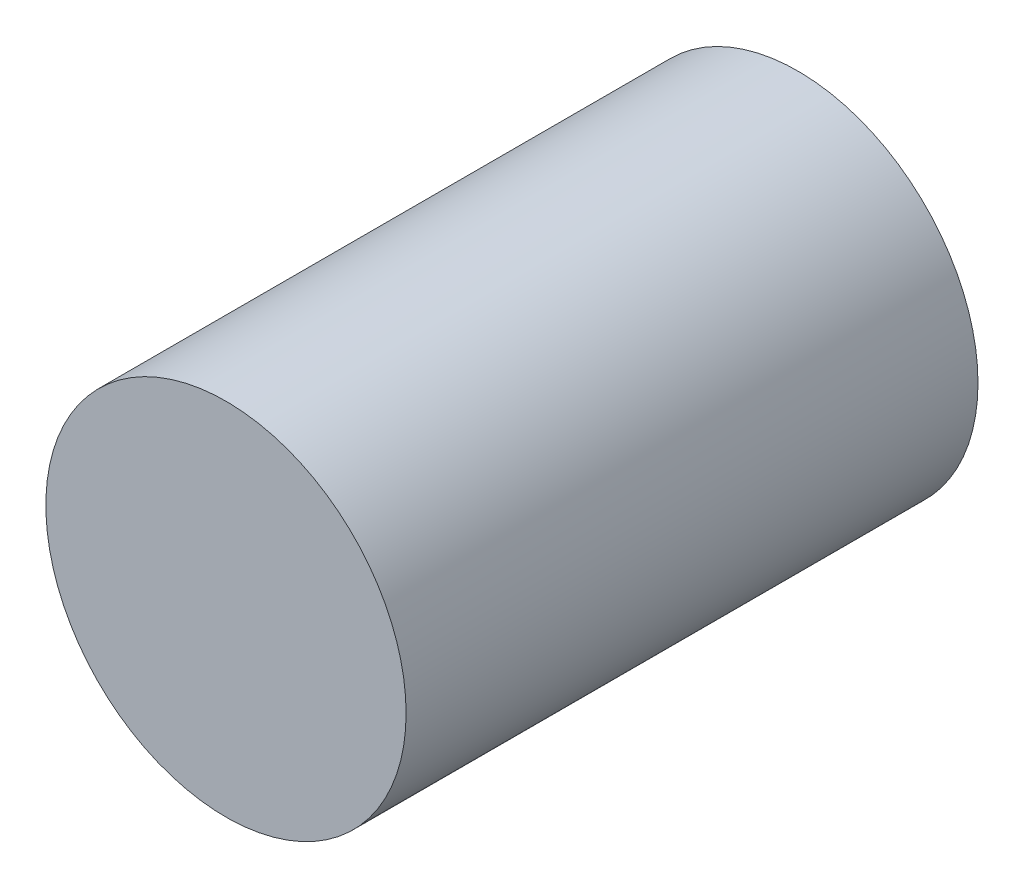
ISO-10303-21;
HEADER;
FILE_DESCRIPTION(('STEP AP214'),'2;1');
FILE_NAME('part.step','',(''),(''),'','','');
FILE_SCHEMA(('AUTOMOTIVE_DESIGN { 1 0 10303 214 1 1 1 1 }'));
ENDSEC;
DATA;
#1=APPLICATION_CONTEXT('core data for automotive mechanical design processes');
#2=APPLICATION_PROTOCOL_DEFINITION('international standard','automotive_design',2000,#1);
#3=PRODUCT_CONTEXT('',#1,'mechanical');
#4=PRODUCT('Part','Part','',(#3));
#5=PRODUCT_RELATED_PRODUCT_CATEGORY('part','',(#4));
#6=PRODUCT_DEFINITION_FORMATION('','',#4);
#7=PRODUCT_DEFINITION_CONTEXT('part definition',#1,'design');
#8=PRODUCT_DEFINITION('design','',#6,#7);
#9=PRODUCT_DEFINITION_SHAPE('','',#8);
#10=(LENGTH_UNIT() NAMED_UNIT(*) SI_UNIT(.MILLI.,.METRE.));
#11=(NAMED_UNIT(*) PLANE_ANGLE_UNIT() SI_UNIT($,.RADIAN.));
#12=(NAMED_UNIT(*) SI_UNIT($,.STERADIAN.) SOLID_ANGLE_UNIT());
#13=UNCERTAINTY_MEASURE_WITH_UNIT(LENGTH_MEASURE(1.E-05),#10,'distance_accuracy_value','');
#14=(GEOMETRIC_REPRESENTATION_CONTEXT(3) GLOBAL_UNCERTAINTY_ASSIGNED_CONTEXT((#13)) GLOBAL_UNIT_ASSIGNED_CONTEXT((#10,
#11,#12)) REPRESENTATION_CONTEXT('',''));
#15=CARTESIAN_POINT('',(0.,0.,0.));
#16=DIRECTION('',(0.,0.,1.));
#17=DIRECTION('',(1.,0.,0.));
#18=AXIS2_PLACEMENT_3D('',#15,#16,#17);
#19=CARTESIAN_POINT('',(0.,0.,3.175));
#20=DIRECTION('',(0.,0.,-1.));
#21=DIRECTION('',(-1.,0.,0.));
#22=AXIS2_PLACEMENT_3D('',#19,#20,#21);
#23=CYLINDRICAL_SURFACE('',#22,1.);
#24=CARTESIAN_POINT('',(0.,0.,3.175));
#25=DIRECTION('',(0.,0.,1.));
#26=DIRECTION('',(1.,0.,0.));
#27=AXIS2_PLACEMENT_3D('',#24,#25,#26);
#28=CIRCLE('',#27,1.);
#29=CARTESIAN_POINT('',(1.,0.,3.175));
#30=VERTEX_POINT('',#29);
#31=EDGE_CURVE('E10',#30,#30,#28,.T.);
#32=ORIENTED_EDGE('',*,*,#31,.F.);
#33=EDGE_LOOP('',(#32));
#34=FACE_BOUND('',#33,.T.);
#35=CARTESIAN_POINT('',(0.,0.,0.));
#36=DIRECTION('',(0.,0.,1.));
#37=DIRECTION('',(1.,0.,0.));
#38=AXIS2_PLACEMENT_3D('',#35,#36,#37);
#39=CIRCLE('',#38,1.);
#40=CARTESIAN_POINT('',(1.,0.,0.));
#41=VERTEX_POINT('',#40);
#42=EDGE_CURVE('E40',#41,#41,#39,.T.);
#43=ORIENTED_EDGE('',*,*,#42,.T.);
#44=EDGE_LOOP('',(#43));
#45=FACE_BOUND('',#44,.T.);
#46=ADVANCED_FACE('F37',(#34,#45),#23,.T.);
#47=CARTESIAN_POINT('',(0.,0.,3.175));
#48=DIRECTION('',(0.,0.,1.));
#49=DIRECTION('',(1.,0.,0.));
#50=AXIS2_PLACEMENT_3D('',#47,#48,#49);
#51=PLANE('',#50);
#52=ORIENTED_EDGE('',*,*,#31,.T.);
#53=EDGE_LOOP('',(#52));
#54=FACE_BOUND('',#53,.T.);
#55=ADVANCED_FACE('F54',(#54),#51,.T.);
#56=CARTESIAN_POINT('',(0.,0.,0.));
#57=DIRECTION('',(0.,0.,1.));
#58=DIRECTION('',(1.,0.,0.));
#59=AXIS2_PLACEMENT_3D('',#56,#57,#58);
#60=PLANE('',#59);
#61=ORIENTED_EDGE('',*,*,#42,.F.);
#62=EDGE_LOOP('',(#61));
#63=FACE_BOUND('',#62,.T.);
#64=ADVANCED_FACE('F52',(#63),#60,.F.);
#65=CLOSED_SHELL('',(#46,#55,#64));
#66=MANIFOLD_SOLID_BREP('B2',#65);
#67=ADVANCED_BREP_SHAPE_REPRESENTATION('',(#18,#66),#14);
#68=SHAPE_DEFINITION_REPRESENTATION(#9,#67);
ENDSEC;
END-ISO-10303-21;
